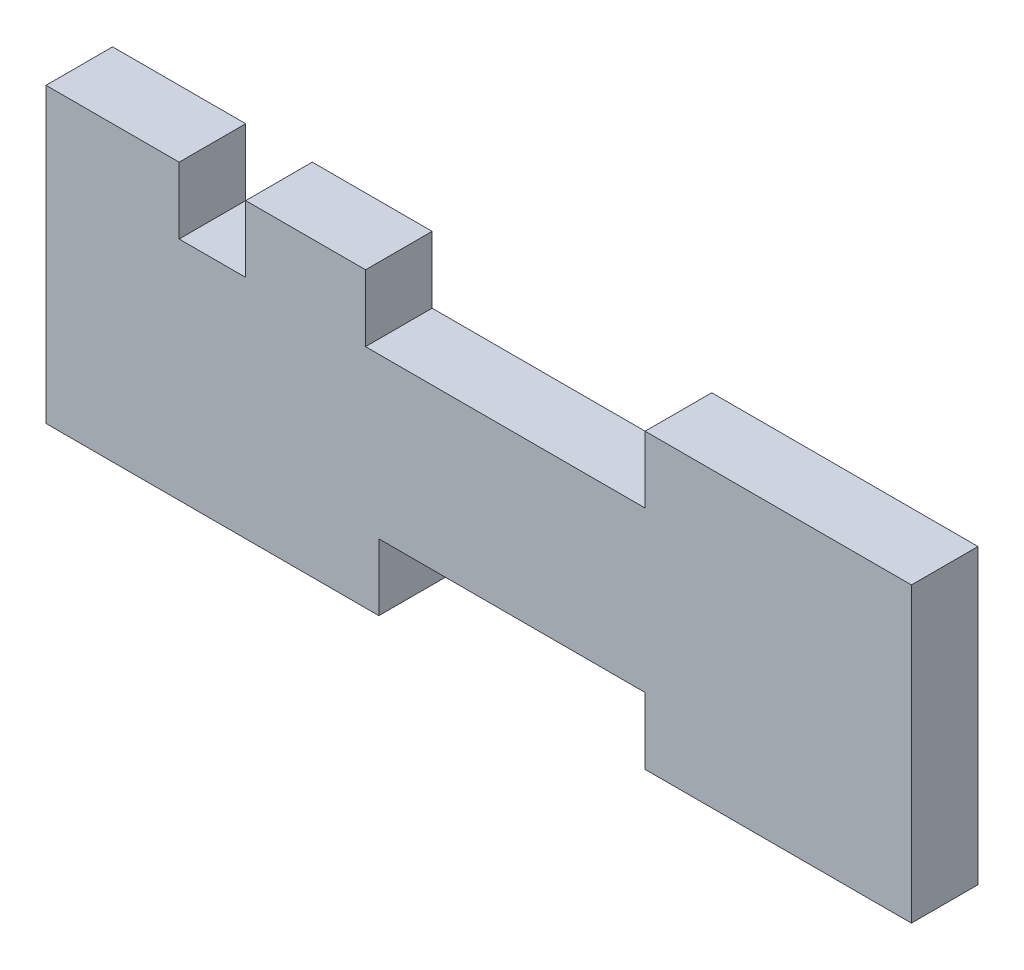
ISO-10303-21;
HEADER;
FILE_DESCRIPTION(('STEP AP214'),'2;1');
FILE_NAME('part.step','',(''),(''),'','','');
FILE_SCHEMA(('AUTOMOTIVE_DESIGN { 1 0 10303 214 1 1 1 1 }'));
ENDSEC;
DATA;
#1=APPLICATION_CONTEXT('core data for automotive mechanical design processes');
#2=APPLICATION_PROTOCOL_DEFINITION('international standard','automotive_design',2000,#1);
#3=PRODUCT_CONTEXT('',#1,'mechanical');
#4=PRODUCT('Part','Part','',(#3));
#5=PRODUCT_RELATED_PRODUCT_CATEGORY('part','',(#4));
#6=PRODUCT_DEFINITION_FORMATION('','',#4);
#7=PRODUCT_DEFINITION_CONTEXT('part definition',#1,'design');
#8=PRODUCT_DEFINITION('design','',#6,#7);
#9=PRODUCT_DEFINITION_SHAPE('','',#8);
#10=(LENGTH_UNIT() NAMED_UNIT(*) SI_UNIT(.MILLI.,.METRE.));
#11=(NAMED_UNIT(*) PLANE_ANGLE_UNIT() SI_UNIT($,.RADIAN.));
#12=(NAMED_UNIT(*) SI_UNIT($,.STERADIAN.) SOLID_ANGLE_UNIT());
#13=UNCERTAINTY_MEASURE_WITH_UNIT(LENGTH_MEASURE(1.E-05),#10,'distance_accuracy_value','');
#14=(GEOMETRIC_REPRESENTATION_CONTEXT(3) GLOBAL_UNCERTAINTY_ASSIGNED_CONTEXT((#13)) GLOBAL_UNIT_ASSIGNED_CONTEXT((#10,
#11,#12)) REPRESENTATION_CONTEXT('',''));
#15=CARTESIAN_POINT('',(0.,0.,0.));
#16=DIRECTION('',(0.,0.,1.));
#17=DIRECTION('',(1.,0.,0.));
#18=AXIS2_PLACEMENT_3D('',#15,#16,#17);
#19=CARTESIAN_POINT('',(0.,17.,5.));
#20=DIRECTION('',(0.,1.,0.));
#21=DIRECTION('',(0.,0.,1.));
#22=AXIS2_PLACEMENT_3D('',#19,#20,#21);
#23=PLANE('',#22);
#24=DIRECTION('',(1.,0.,0.));
#25=VECTOR('',#24,1.);
#26=CARTESIAN_POINT('',(0.,17.,5.));
#27=LINE('',#26,#25);
#28=CARTESIAN_POINT('',(-50.,17.,5.));
#29=VERTEX_POINT('',#28);
#30=CARTESIAN_POINT('',(-41.,17.,5.));
#31=VERTEX_POINT('',#30);
#32=EDGE_CURVE('E276',#29,#31,#27,.T.);
#33=ORIENTED_EDGE('',*,*,#32,.T.);
#34=DIRECTION('',(0.,0.,1.));
#35=VECTOR('',#34,1.);
#36=CARTESIAN_POINT('',(-41.,17.,0.));
#37=LINE('',#36,#35);
#38=CARTESIAN_POINT('',(-41.,17.,0.));
#39=VERTEX_POINT('',#38);
#40=EDGE_CURVE('E284',#39,#31,#37,.T.);
#41=ORIENTED_EDGE('',*,*,#40,.F.);
#42=DIRECTION('',(1.,0.,0.));
#43=VECTOR('',#42,1.);
#44=CARTESIAN_POINT('',(0.,17.,0.));
#45=LINE('',#44,#43);
#46=CARTESIAN_POINT('',(-50.,17.,0.));
#47=VERTEX_POINT('',#46);
#48=EDGE_CURVE('E207',#47,#39,#45,.T.);
#49=ORIENTED_EDGE('',*,*,#48,.F.);
#50=DIRECTION('',(0.,0.,-1.));
#51=VECTOR('',#50,1.);
#52=CARTESIAN_POINT('',(-50.,17.,5.));
#53=LINE('',#52,#51);
#54=EDGE_CURVE('E221',#29,#47,#53,.T.);
#55=ORIENTED_EDGE('',*,*,#54,.F.);
#56=EDGE_LOOP('',(#33,#41,#49,#55));
#57=FACE_BOUND('',#56,.T.);
#58=ADVANCED_FACE('F35',(#57),#23,.T.);
#59=CARTESIAN_POINT('',(-65.,0.,5.));
#60=DIRECTION('',(-1.,0.,0.));
#61=DIRECTION('',(0.,0.,1.));
#62=AXIS2_PLACEMENT_3D('',#59,#60,#61);
#63=PLANE('',#62);
#64=DIRECTION('',(0.,1.,0.));
#65=VECTOR('',#64,1.);
#66=CARTESIAN_POINT('',(-65.,0.,0.));
#67=LINE('',#66,#65);
#68=CARTESIAN_POINT('',(-65.,-5.00000000000001,0.));
#69=VERTEX_POINT('',#68);
#70=CARTESIAN_POINT('',(-65.,17.,0.));
#71=VERTEX_POINT('',#70);
#72=EDGE_CURVE('E180',#69,#71,#67,.T.);
#73=ORIENTED_EDGE('',*,*,#72,.F.);
#74=DIRECTION('',(0.,0.,-1.));
#75=VECTOR('',#74,1.);
#76=CARTESIAN_POINT('',(-65.,-5.00000000000001,5.));
#77=LINE('',#76,#75);
#78=CARTESIAN_POINT('',(-65.,-5.00000000000001,5.));
#79=VERTEX_POINT('',#78);
#80=EDGE_CURVE('E11',#79,#69,#77,.T.);
#81=ORIENTED_EDGE('',*,*,#80,.F.);
#82=DIRECTION('',(0.,1.,0.));
#83=VECTOR('',#82,1.);
#84=CARTESIAN_POINT('',(-65.,0.,5.));
#85=LINE('',#84,#83);
#86=CARTESIAN_POINT('',(-65.,17.,5.));
#87=VERTEX_POINT('',#86);
#88=EDGE_CURVE('E217',#79,#87,#85,.T.);
#89=ORIENTED_EDGE('',*,*,#88,.T.);
#90=DIRECTION('',(0.,0.,-1.));
#91=VECTOR('',#90,1.);
#92=CARTESIAN_POINT('',(-65.,17.,5.));
#93=LINE('',#92,#91);
#94=EDGE_CURVE('E59',#87,#71,#93,.T.);
#95=ORIENTED_EDGE('',*,*,#94,.T.);
#96=EDGE_LOOP('',(#73,#81,#89,#95));
#97=FACE_BOUND('',#96,.T.);
#98=ADVANCED_FACE('F37',(#97),#63,.T.);
#99=CARTESIAN_POINT('',(0.,-5.00000000000001,5.));
#100=DIRECTION('',(0.,1.,0.));
#101=DIRECTION('',(0.,0.,1.));
#102=AXIS2_PLACEMENT_3D('',#99,#100,#101);
#103=PLANE('',#102);
#104=DIRECTION('',(1.,0.,0.));
#105=VECTOR('',#104,1.);
#106=CARTESIAN_POINT('',(0.,-5.00000000000001,0.));
#107=LINE('',#106,#105);
#108=CARTESIAN_POINT('',(-40.,-5.00000000000001,0.));
#109=VERTEX_POINT('',#108);
#110=EDGE_CURVE('E182',#69,#109,#107,.T.);
#111=ORIENTED_EDGE('',*,*,#110,.T.);
#112=DIRECTION('',(0.,0.,-1.));
#113=VECTOR('',#112,1.);
#114=CARTESIAN_POINT('',(-40.,-5.00000000000001,5.));
#115=LINE('',#114,#113);
#116=CARTESIAN_POINT('',(-40.,-5.00000000000001,5.));
#117=VERTEX_POINT('',#116);
#118=EDGE_CURVE('E43',#117,#109,#115,.T.);
#119=ORIENTED_EDGE('',*,*,#118,.F.);
#120=DIRECTION('',(1.,0.,0.));
#121=VECTOR('',#120,1.);
#122=CARTESIAN_POINT('',(0.,-5.00000000000001,5.));
#123=LINE('',#122,#121);
#124=EDGE_CURVE('E259',#79,#117,#123,.T.);
#125=ORIENTED_EDGE('',*,*,#124,.F.);
#126=ORIENTED_EDGE('',*,*,#80,.T.);
#127=EDGE_LOOP('',(#111,#119,#125,#126));
#128=FACE_BOUND('',#127,.T.);
#129=ADVANCED_FACE('F246',(#128),#103,.F.);
#130=CARTESIAN_POINT('',(-40.,0.,5.));
#131=DIRECTION('',(1.,0.,0.));
#132=DIRECTION('',(0.,0.,-1.));
#133=AXIS2_PLACEMENT_3D('',#130,#131,#132);
#134=PLANE('',#133);
#135=DIRECTION('',(0.,-1.,0.));
#136=VECTOR('',#135,1.);
#137=CARTESIAN_POINT('',(-40.,0.,0.));
#138=LINE('',#137,#136);
#139=CARTESIAN_POINT('',(-40.,0.,0.));
#140=VERTEX_POINT('',#139);
#141=EDGE_CURVE('E186',#140,#109,#138,.T.);
#142=ORIENTED_EDGE('',*,*,#141,.F.);
#143=DIRECTION('',(0.,0.,-1.));
#144=VECTOR('',#143,1.);
#145=CARTESIAN_POINT('',(-40.,0.,5.));
#146=LINE('',#145,#144);
#147=CARTESIAN_POINT('',(-40.,0.,5.));
#148=VERTEX_POINT('',#147);
#149=EDGE_CURVE('E236',#148,#140,#146,.T.);
#150=ORIENTED_EDGE('',*,*,#149,.F.);
#151=DIRECTION('',(0.,-1.,0.));
#152=VECTOR('',#151,1.);
#153=CARTESIAN_POINT('',(-40.,0.,5.));
#154=LINE('',#153,#152);
#155=EDGE_CURVE('E243',#148,#117,#154,.T.);
#156=ORIENTED_EDGE('',*,*,#155,.T.);
#157=ORIENTED_EDGE('',*,*,#118,.T.);
#158=EDGE_LOOP('',(#142,#150,#156,#157));
#159=FACE_BOUND('',#158,.T.);
#160=ADVANCED_FACE('F241',(#159),#134,.T.);
#161=CARTESIAN_POINT('',(0.,0.,5.));
#162=DIRECTION('',(0.,-1.,0.));
#163=DIRECTION('',(1.,0.,0.));
#164=AXIS2_PLACEMENT_3D('',#161,#162,#163);
#165=PLANE('',#164);
#166=DIRECTION('',(-1.,0.,0.));
#167=VECTOR('',#166,1.);
#168=CARTESIAN_POINT('',(0.,0.,0.));
#169=LINE('',#168,#167);
#170=CARTESIAN_POINT('',(-20.,0.,0.));
#171=VERTEX_POINT('',#170);
#172=EDGE_CURVE('E189',#171,#140,#169,.T.);
#173=ORIENTED_EDGE('',*,*,#172,.F.);
#174=DIRECTION('',(0.,0.,-1.));
#175=VECTOR('',#174,1.);
#176=CARTESIAN_POINT('',(-20.,0.,5.));
#177=LINE('',#176,#175);
#178=CARTESIAN_POINT('',(-20.,0.,5.));
#179=VERTEX_POINT('',#178);
#180=EDGE_CURVE('E234',#179,#171,#177,.T.);
#181=ORIENTED_EDGE('',*,*,#180,.F.);
#182=DIRECTION('',(-1.,0.,0.));
#183=VECTOR('',#182,1.);
#184=CARTESIAN_POINT('',(0.,0.,5.));
#185=LINE('',#184,#183);
#186=EDGE_CURVE('E257',#179,#148,#185,.T.);
#187=ORIENTED_EDGE('',*,*,#186,.T.);
#188=ORIENTED_EDGE('',*,*,#149,.T.);
#189=EDGE_LOOP('',(#173,#181,#187,#188));
#190=FACE_BOUND('',#189,.T.);
#191=ADVANCED_FACE('F253',(#190),#165,.T.);
#192=CARTESIAN_POINT('',(-20.,0.,5.));
#193=DIRECTION('',(1.,0.,0.));
#194=DIRECTION('',(0.,0.,-1.));
#195=AXIS2_PLACEMENT_3D('',#192,#193,#194);
#196=PLANE('',#195);
#197=DIRECTION('',(0.,-1.,0.));
#198=VECTOR('',#197,1.);
#199=CARTESIAN_POINT('',(-20.,0.,0.));
#200=LINE('',#199,#198);
#201=CARTESIAN_POINT('',(-20.,-5.00000000000001,0.));
#202=VERTEX_POINT('',#201);
#203=EDGE_CURVE('E192',#171,#202,#200,.T.);
#204=ORIENTED_EDGE('',*,*,#203,.T.);
#205=DIRECTION('',(0.,0.,-1.));
#206=VECTOR('',#205,1.);
#207=CARTESIAN_POINT('',(-20.,-5.00000000000001,5.));
#208=LINE('',#207,#206);
#209=CARTESIAN_POINT('',(-20.,-5.00000000000001,5.));
#210=VERTEX_POINT('',#209);
#211=EDGE_CURVE('E232',#210,#202,#208,.T.);
#212=ORIENTED_EDGE('',*,*,#211,.F.);
#213=DIRECTION('',(0.,-1.,0.));
#214=VECTOR('',#213,1.);
#215=CARTESIAN_POINT('',(-20.,0.,5.));
#216=LINE('',#215,#214);
#217=EDGE_CURVE('E261',#179,#210,#216,.T.);
#218=ORIENTED_EDGE('',*,*,#217,.F.);
#219=ORIENTED_EDGE('',*,*,#180,.T.);
#220=EDGE_LOOP('',(#204,#212,#218,#219));
#221=FACE_BOUND('',#220,.T.);
#222=ADVANCED_FACE('F327',(#221),#196,.F.);
#223=CARTESIAN_POINT('',(0.,-5.,5.));
#224=DIRECTION('',(0.,-1.,0.));
#225=DIRECTION('',(1.,0.,0.));
#226=AXIS2_PLACEMENT_3D('',#223,#224,#225);
#227=PLANE('',#226);
#228=DIRECTION('',(-1.,0.,0.));
#229=VECTOR('',#228,1.);
#230=CARTESIAN_POINT('',(0.,-5.,0.));
#231=LINE('',#230,#229);
#232=CARTESIAN_POINT('',(0.,-5.,0.));
#233=VERTEX_POINT('',#232);
#234=EDGE_CURVE('E195',#233,#202,#231,.T.);
#235=ORIENTED_EDGE('',*,*,#234,.F.);
#236=DIRECTION('',(0.,0.,-1.));
#237=VECTOR('',#236,1.);
#238=CARTESIAN_POINT('',(0.,-5.,5.));
#239=LINE('',#238,#237);
#240=CARTESIAN_POINT('',(0.,-5.,5.));
#241=VERTEX_POINT('',#240);
#242=EDGE_CURVE('E230',#241,#233,#239,.T.);
#243=ORIENTED_EDGE('',*,*,#242,.F.);
#244=DIRECTION('',(-1.,0.,0.));
#245=VECTOR('',#244,1.);
#246=CARTESIAN_POINT('',(0.,-5.,5.));
#247=LINE('',#246,#245);
#248=EDGE_CURVE('E267',#241,#210,#247,.T.);
#249=ORIENTED_EDGE('',*,*,#248,.T.);
#250=ORIENTED_EDGE('',*,*,#211,.T.);
#251=EDGE_LOOP('',(#235,#243,#249,#250));
#252=FACE_BOUND('',#251,.T.);
#253=ADVANCED_FACE('F323',(#252),#227,.T.);
#254=CARTESIAN_POINT('',(0.,0.,5.));
#255=DIRECTION('',(-1.,0.,0.));
#256=DIRECTION('',(0.,0.,1.));
#257=AXIS2_PLACEMENT_3D('',#254,#255,#256);
#258=PLANE('',#257);
#259=DIRECTION('',(0.,1.,0.));
#260=VECTOR('',#259,1.);
#261=CARTESIAN_POINT('',(0.,0.,0.));
#262=LINE('',#261,#260);
#263=CARTESIAN_POINT('',(0.,17.,0.));
#264=VERTEX_POINT('',#263);
#265=EDGE_CURVE('E198',#233,#264,#262,.T.);
#266=ORIENTED_EDGE('',*,*,#265,.T.);
#267=DIRECTION('',(0.,0.,-1.));
#268=VECTOR('',#267,1.);
#269=CARTESIAN_POINT('',(0.,17.,5.));
#270=LINE('',#269,#268);
#271=CARTESIAN_POINT('',(0.,17.,5.));
#272=VERTEX_POINT('',#271);
#273=EDGE_CURVE('E227',#272,#264,#270,.T.);
#274=ORIENTED_EDGE('',*,*,#273,.F.);
#275=DIRECTION('',(0.,1.,0.));
#276=VECTOR('',#275,1.);
#277=CARTESIAN_POINT('',(0.,0.,5.));
#278=LINE('',#277,#276);
#279=EDGE_CURVE('E270',#241,#272,#278,.T.);
#280=ORIENTED_EDGE('',*,*,#279,.F.);
#281=ORIENTED_EDGE('',*,*,#242,.T.);
#282=EDGE_LOOP('',(#266,#274,#280,#281));
#283=FACE_BOUND('',#282,.T.);
#284=ADVANCED_FACE('F319',(#283),#258,.F.);
#285=CARTESIAN_POINT('',(0.,17.,5.));
#286=DIRECTION('',(0.,-1.,0.));
#287=DIRECTION('',(0.,0.,-1.));
#288=AXIS2_PLACEMENT_3D('',#285,#286,#287);
#289=PLANE('',#288);
#290=DIRECTION('',(-1.,0.,0.));
#291=VECTOR('',#290,1.);
#292=CARTESIAN_POINT('',(0.,17.,0.));
#293=LINE('',#292,#291);
#294=CARTESIAN_POINT('',(-20.,17.,0.));
#295=VERTEX_POINT('',#294);
#296=EDGE_CURVE('E200',#264,#295,#293,.T.);
#297=ORIENTED_EDGE('',*,*,#296,.T.);
#298=DIRECTION('',(0.,0.,-1.));
#299=VECTOR('',#298,1.);
#300=CARTESIAN_POINT('',(-20.,17.,5.));
#301=LINE('',#300,#299);
#302=CARTESIAN_POINT('',(-20.,17.,5.));
#303=VERTEX_POINT('',#302);
#304=EDGE_CURVE('E225',#303,#295,#301,.T.);
#305=ORIENTED_EDGE('',*,*,#304,.F.);
#306=DIRECTION('',(-1.,0.,0.));
#307=VECTOR('',#306,1.);
#308=CARTESIAN_POINT('',(0.,17.,5.));
#309=LINE('',#308,#307);
#310=EDGE_CURVE('E272',#272,#303,#309,.T.);
#311=ORIENTED_EDGE('',*,*,#310,.F.);
#312=ORIENTED_EDGE('',*,*,#273,.T.);
#313=EDGE_LOOP('',(#297,#305,#311,#312));
#314=FACE_BOUND('',#313,.T.);
#315=ADVANCED_FACE('F315',(#314),#289,.F.);
#316=CARTESIAN_POINT('',(-20.,0.,5.));
#317=DIRECTION('',(-1.,0.,0.));
#318=DIRECTION('',(0.,0.,1.));
#319=AXIS2_PLACEMENT_3D('',#316,#317,#318);
#320=PLANE('',#319);
#321=DIRECTION('',(0.,1.,0.));
#322=VECTOR('',#321,1.);
#323=CARTESIAN_POINT('',(-20.,0.,0.));
#324=LINE('',#323,#322);
#325=CARTESIAN_POINT('',(-20.,12.,0.));
#326=VERTEX_POINT('',#325);
#327=EDGE_CURVE('E203',#326,#295,#324,.T.);
#328=ORIENTED_EDGE('',*,*,#327,.F.);
#329=DIRECTION('',(0.,0.,-1.));
#330=VECTOR('',#329,1.);
#331=CARTESIAN_POINT('',(-20.,12.,5.));
#332=LINE('',#331,#330);
#333=CARTESIAN_POINT('',(-20.,12.,5.));
#334=VERTEX_POINT('',#333);
#335=EDGE_CURVE('E223',#334,#326,#332,.T.);
#336=ORIENTED_EDGE('',*,*,#335,.F.);
#337=DIRECTION('',(0.,1.,0.));
#338=VECTOR('',#337,1.);
#339=CARTESIAN_POINT('',(-20.,0.,5.));
#340=LINE('',#339,#338);
#341=EDGE_CURVE('E274',#334,#303,#340,.T.);
#342=ORIENTED_EDGE('',*,*,#341,.T.);
#343=ORIENTED_EDGE('',*,*,#304,.T.);
#344=EDGE_LOOP('',(#328,#336,#342,#343));
#345=FACE_BOUND('',#344,.T.);
#346=ADVANCED_FACE('F306',(#345),#320,.T.);
#347=CARTESIAN_POINT('',(0.,12.,5.));
#348=DIRECTION('',(0.,-1.,0.));
#349=DIRECTION('',(1.,0.,0.));
#350=AXIS2_PLACEMENT_3D('',#347,#348,#349);
#351=PLANE('',#350);
#352=DIRECTION('',(-1.,0.,0.));
#353=VECTOR('',#352,1.);
#354=CARTESIAN_POINT('',(0.,12.,0.));
#355=LINE('',#354,#353);
#356=CARTESIAN_POINT('',(-41.,12.,0.));
#357=VERTEX_POINT('',#356);
#358=EDGE_CURVE('E50',#326,#357,#355,.T.);
#359=ORIENTED_EDGE('',*,*,#358,.T.);
#360=DIRECTION('',(0.,0.,-1.));
#361=VECTOR('',#360,1.);
#362=CARTESIAN_POINT('',(-41.,12.,5.));
#363=LINE('',#362,#361);
#364=CARTESIAN_POINT('',(-41.,12.,5.));
#365=VERTEX_POINT('',#364);
#366=EDGE_CURVE('E506',#365,#357,#363,.T.);
#367=ORIENTED_EDGE('',*,*,#366,.F.);
#368=DIRECTION('',(-1.,0.,0.));
#369=VECTOR('',#368,1.);
#370=CARTESIAN_POINT('',(0.,12.,5.));
#371=LINE('',#370,#369);
#372=EDGE_CURVE('E161',#334,#365,#371,.T.);
#373=ORIENTED_EDGE('',*,*,#372,.F.);
#374=ORIENTED_EDGE('',*,*,#335,.T.);
#375=EDGE_LOOP('',(#359,#367,#373,#374));
#376=FACE_BOUND('',#375,.T.);
#377=ADVANCED_FACE('F299',(#376),#351,.F.);
#378=CARTESIAN_POINT('',(-50.,0.,5.));
#379=DIRECTION('',(1.,0.,0.));
#380=DIRECTION('',(0.,0.,-1.));
#381=AXIS2_PLACEMENT_3D('',#378,#379,#380);
#382=PLANE('',#381);
#383=DIRECTION('',(0.,-1.,0.));
#384=VECTOR('',#383,1.);
#385=CARTESIAN_POINT('',(-50.,0.,0.));
#386=LINE('',#385,#384);
#387=CARTESIAN_POINT('',(-50.,12.,0.));
#388=VERTEX_POINT('',#387);
#389=EDGE_CURVE('E210',#47,#388,#386,.T.);
#390=ORIENTED_EDGE('',*,*,#389,.T.);
#391=DIRECTION('',(0.,0.,-1.));
#392=VECTOR('',#391,1.);
#393=CARTESIAN_POINT('',(-50.,12.,5.));
#394=LINE('',#393,#392);
#395=CARTESIAN_POINT('',(-50.,12.,5.));
#396=VERTEX_POINT('',#395);
#397=EDGE_CURVE('E170',#396,#388,#394,.T.);
#398=ORIENTED_EDGE('',*,*,#397,.F.);
#399=DIRECTION('',(0.,-1.,0.));
#400=VECTOR('',#399,1.);
#401=CARTESIAN_POINT('',(-50.,0.,5.));
#402=LINE('',#401,#400);
#403=EDGE_CURVE('E156',#29,#396,#402,.T.);
#404=ORIENTED_EDGE('',*,*,#403,.F.);
#405=ORIENTED_EDGE('',*,*,#54,.T.);
#406=EDGE_LOOP('',(#390,#398,#404,#405));
#407=FACE_BOUND('',#406,.T.);
#408=ADVANCED_FACE('F297',(#407),#382,.F.);
#409=CARTESIAN_POINT('',(-55.,12.,0.));
#410=VERTEX_POINT('',#409);
#411=EDGE_CURVE('E166',#388,#410,#355,.T.);
#412=ORIENTED_EDGE('',*,*,#411,.T.);
#413=DIRECTION('',(0.,0.,-1.));
#414=VECTOR('',#413,1.);
#415=CARTESIAN_POINT('',(-55.,12.,5.));
#416=LINE('',#415,#414);
#417=CARTESIAN_POINT('',(-55.,12.,5.));
#418=VERTEX_POINT('',#417);
#419=EDGE_CURVE('E163',#418,#410,#416,.T.);
#420=ORIENTED_EDGE('',*,*,#419,.F.);
#421=EDGE_CURVE('E147',#396,#418,#371,.T.);
#422=ORIENTED_EDGE('',*,*,#421,.F.);
#423=ORIENTED_EDGE('',*,*,#397,.T.);
#424=EDGE_LOOP('',(#412,#420,#422,#423));
#425=FACE_BOUND('',#424,.T.);
#426=ADVANCED_FACE('F164',(#425),#351,.F.);
#427=CARTESIAN_POINT('',(-55.,0.,5.));
#428=DIRECTION('',(1.,0.,0.));
#429=DIRECTION('',(0.,0.,-1.));
#430=AXIS2_PLACEMENT_3D('',#427,#428,#429);
#431=PLANE('',#430);
#432=DIRECTION('',(0.,-1.,0.));
#433=VECTOR('',#432,1.);
#434=CARTESIAN_POINT('',(-55.,0.,0.));
#435=LINE('',#434,#433);
#436=CARTESIAN_POINT('',(-55.,17.,0.));
#437=VERTEX_POINT('',#436);
#438=EDGE_CURVE('E212',#437,#410,#435,.T.);
#439=ORIENTED_EDGE('',*,*,#438,.F.);
#440=DIRECTION('',(0.,0.,-1.));
#441=VECTOR('',#440,1.);
#442=CARTESIAN_POINT('',(-55.,17.,5.));
#443=LINE('',#442,#441);
#444=CARTESIAN_POINT('',(-55.,17.,5.));
#445=VERTEX_POINT('',#444);
#446=EDGE_CURVE('E171',#445,#437,#443,.T.);
#447=ORIENTED_EDGE('',*,*,#446,.F.);
#448=DIRECTION('',(0.,-1.,0.));
#449=VECTOR('',#448,1.);
#450=CARTESIAN_POINT('',(-55.,0.,5.));
#451=LINE('',#450,#449);
#452=EDGE_CURVE('E153',#445,#418,#451,.T.);
#453=ORIENTED_EDGE('',*,*,#452,.T.);
#454=ORIENTED_EDGE('',*,*,#419,.T.);
#455=EDGE_LOOP('',(#439,#447,#453,#454));
#456=FACE_BOUND('',#455,.T.);
#457=ADVANCED_FACE('F173',(#456),#431,.T.);
#458=CARTESIAN_POINT('',(0.,17.,5.));
#459=DIRECTION('',(0.,1.,0.));
#460=DIRECTION('',(0.,0.,1.));
#461=AXIS2_PLACEMENT_3D('',#458,#459,#460);
#462=PLANE('',#461);
#463=DIRECTION('',(1.,0.,0.));
#464=VECTOR('',#463,1.);
#465=CARTESIAN_POINT('',(0.,17.,0.));
#466=LINE('',#465,#464);
#467=EDGE_CURVE('E214',#71,#437,#466,.T.);
#468=ORIENTED_EDGE('',*,*,#467,.F.);
#469=ORIENTED_EDGE('',*,*,#94,.F.);
#470=DIRECTION('',(1.,0.,0.));
#471=VECTOR('',#470,1.);
#472=CARTESIAN_POINT('',(0.,17.,5.));
#473=LINE('',#472,#471);
#474=EDGE_CURVE('E174',#87,#445,#473,.T.);
#475=ORIENTED_EDGE('',*,*,#474,.T.);
#476=ORIENTED_EDGE('',*,*,#446,.T.);
#477=EDGE_LOOP('',(#468,#469,#475,#476));
#478=FACE_BOUND('',#477,.T.);
#479=ADVANCED_FACE('F294',(#478),#462,.T.);
#480=CARTESIAN_POINT('',(0.,0.,5.));
#481=DIRECTION('',(0.,0.,1.));
#482=DIRECTION('',(1.,0.,0.));
#483=AXIS2_PLACEMENT_3D('',#480,#481,#482);
#484=PLANE('',#483);
#485=ORIENTED_EDGE('',*,*,#372,.T.);
#486=DIRECTION('',(0.,-1.,0.));
#487=VECTOR('',#486,1.);
#488=CARTESIAN_POINT('',(-41.,17.,5.));
#489=LINE('',#488,#487);
#490=EDGE_CURVE('E183',#31,#365,#489,.T.);
#491=ORIENTED_EDGE('',*,*,#490,.F.);
#492=ORIENTED_EDGE('',*,*,#32,.F.);
#493=ORIENTED_EDGE('',*,*,#403,.T.);
#494=ORIENTED_EDGE('',*,*,#421,.T.);
#495=ORIENTED_EDGE('',*,*,#452,.F.);
#496=ORIENTED_EDGE('',*,*,#474,.F.);
#497=ORIENTED_EDGE('',*,*,#88,.F.);
#498=ORIENTED_EDGE('',*,*,#124,.T.);
#499=ORIENTED_EDGE('',*,*,#155,.F.);
#500=ORIENTED_EDGE('',*,*,#186,.F.);
#501=ORIENTED_EDGE('',*,*,#217,.T.);
#502=ORIENTED_EDGE('',*,*,#248,.F.);
#503=ORIENTED_EDGE('',*,*,#279,.T.);
#504=ORIENTED_EDGE('',*,*,#310,.T.);
#505=ORIENTED_EDGE('',*,*,#341,.F.);
#506=EDGE_LOOP('',(#485,#491,#492,#493,#494,#495,#496,#497,#498,#499,#500,#501,#502,#503,#504,#505));
#507=FACE_BOUND('',#506,.T.);
#508=ADVANCED_FACE('F150',(#507),#484,.T.);
#509=CARTESIAN_POINT('',(0.,0.,0.));
#510=DIRECTION('',(0.,0.,1.));
#511=DIRECTION('',(1.,0.,0.));
#512=AXIS2_PLACEMENT_3D('',#509,#510,#511);
#513=PLANE('',#512);
#514=DIRECTION('',(0.,1.,0.));
#515=VECTOR('',#514,1.);
#516=CARTESIAN_POINT('',(-41.,12.,0.));
#517=LINE('',#516,#515);
#518=EDGE_CURVE('E291',#357,#39,#517,.T.);
#519=ORIENTED_EDGE('',*,*,#518,.F.);
#520=ORIENTED_EDGE('',*,*,#358,.F.);
#521=ORIENTED_EDGE('',*,*,#327,.T.);
#522=ORIENTED_EDGE('',*,*,#296,.F.);
#523=ORIENTED_EDGE('',*,*,#265,.F.);
#524=ORIENTED_EDGE('',*,*,#234,.T.);
#525=ORIENTED_EDGE('',*,*,#203,.F.);
#526=ORIENTED_EDGE('',*,*,#172,.T.);
#527=ORIENTED_EDGE('',*,*,#141,.T.);
#528=ORIENTED_EDGE('',*,*,#110,.F.);
#529=ORIENTED_EDGE('',*,*,#72,.T.);
#530=ORIENTED_EDGE('',*,*,#467,.T.);
#531=ORIENTED_EDGE('',*,*,#438,.T.);
#532=ORIENTED_EDGE('',*,*,#411,.F.);
#533=ORIENTED_EDGE('',*,*,#389,.F.);
#534=ORIENTED_EDGE('',*,*,#48,.T.);
#535=EDGE_LOOP('',(#519,#520,#521,#522,#523,#524,#525,#526,#527,#528,#529,#530,#531,#532,#533,#534));
#536=FACE_BOUND('',#535,.T.);
#537=ADVANCED_FACE('F249',(#536),#513,.F.);
#538=CARTESIAN_POINT('',(-41.,0.,0.));
#539=DIRECTION('',(1.,0.,0.));
#540=DIRECTION('',(0.,0.,-1.));
#541=AXIS2_PLACEMENT_3D('',#538,#539,#540);
#542=PLANE('',#541);
#543=ORIENTED_EDGE('',*,*,#366,.T.);
#544=ORIENTED_EDGE('',*,*,#518,.T.);
#545=ORIENTED_EDGE('',*,*,#40,.T.);
#546=ORIENTED_EDGE('',*,*,#490,.T.);
#547=EDGE_LOOP('',(#543,#544,#545,#546));
#548=FACE_BOUND('',#547,.T.);
#549=ADVANCED_FACE('F397',(#548),#542,.T.);
#550=CLOSED_SHELL('',(#58,#98,#129,#160,#191,#222,#253,#284,#315,#346,#377,#408,#426,#457,#479,
#508,#537,#549));
#551=MANIFOLD_SOLID_BREP('B2',#550);
#552=ADVANCED_BREP_SHAPE_REPRESENTATION('',(#18,#551),#14);
#553=SHAPE_DEFINITION_REPRESENTATION(#9,#552);
ENDSEC;
END-ISO-10303-21;
